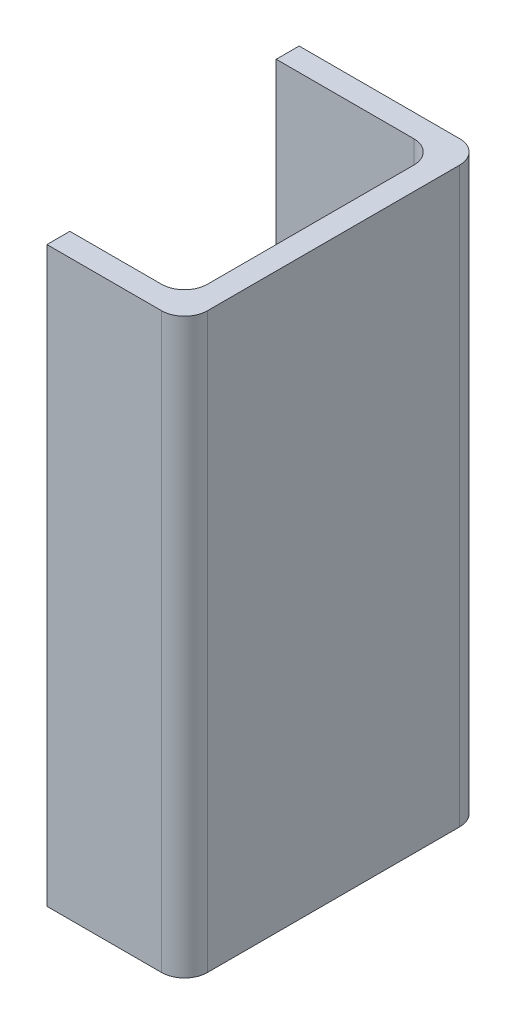
ISO-10303-21;
HEADER;
FILE_DESCRIPTION(('STEP AP214'),'2;1');
FILE_NAME('part.step','',(''),(''),'','','');
FILE_SCHEMA(('AUTOMOTIVE_DESIGN { 1 0 10303 214 1 1 1 1 }'));
ENDSEC;
DATA;
#1=APPLICATION_CONTEXT('core data for automotive mechanical design processes');
#2=APPLICATION_PROTOCOL_DEFINITION('international standard','automotive_design',2000,#1);
#3=PRODUCT_CONTEXT('',#1,'mechanical');
#4=PRODUCT('Part','Part','',(#3));
#5=PRODUCT_RELATED_PRODUCT_CATEGORY('part','',(#4));
#6=PRODUCT_DEFINITION_FORMATION('','',#4);
#7=PRODUCT_DEFINITION_CONTEXT('part definition',#1,'design');
#8=PRODUCT_DEFINITION('design','',#6,#7);
#9=PRODUCT_DEFINITION_SHAPE('','',#8);
#10=(LENGTH_UNIT() NAMED_UNIT(*) SI_UNIT(.MILLI.,.METRE.));
#11=(NAMED_UNIT(*) PLANE_ANGLE_UNIT() SI_UNIT($,.RADIAN.));
#12=(NAMED_UNIT(*) SI_UNIT($,.STERADIAN.) SOLID_ANGLE_UNIT());
#13=UNCERTAINTY_MEASURE_WITH_UNIT(LENGTH_MEASURE(1.E-05),#10,'distance_accuracy_value','');
#14=(GEOMETRIC_REPRESENTATION_CONTEXT(3) GLOBAL_UNCERTAINTY_ASSIGNED_CONTEXT((#13)) GLOBAL_UNIT_ASSIGNED_CONTEXT((#10,
#11,#12)) REPRESENTATION_CONTEXT('',''));
#15=CARTESIAN_POINT('',(0.,0.,0.));
#16=DIRECTION('',(0.,0.,1.));
#17=DIRECTION('',(1.,0.,0.));
#18=AXIS2_PLACEMENT_3D('',#15,#16,#17);
#19=CARTESIAN_POINT('',(0.9,0.625,0.0999999999999998));
#20=DIRECTION('',(0.,1.,0.));
#21=DIRECTION('',(0.707106781186548,0.,-0.707106781186548));
#22=AXIS2_PLACEMENT_3D('',#19,#20,#21);
#23=CYLINDRICAL_SURFACE('',#22,0.05);
#24=CARTESIAN_POINT('',(0.9,-0.625,0.0999999999999998));
#25=DIRECTION('',(0.,-1.,0.));
#26=DIRECTION('',(0.,0.,-1.));
#27=AXIS2_PLACEMENT_3D('',#24,#25,#26);
#28=CIRCLE('',#27,0.05);
#29=CARTESIAN_POINT('',(0.9,-0.625,0.0499999999999998));
#30=VERTEX_POINT('',#29);
#31=CARTESIAN_POINT('',(0.95,-0.625,0.0999999999999998));
#32=VERTEX_POINT('',#31);
#33=EDGE_CURVE('E11',#30,#32,#28,.T.);
#34=ORIENTED_EDGE('',*,*,#33,.T.);
#35=DIRECTION('',(0.,1.,0.));
#36=VECTOR('',#35,1.);
#37=CARTESIAN_POINT('',(0.95,-0.625,0.0999999999999998));
#38=LINE('',#37,#36);
#39=CARTESIAN_POINT('',(0.95,0.625,0.0999999999999998));
#40=VERTEX_POINT('',#39);
#41=EDGE_CURVE('E24',#32,#40,#38,.T.);
#42=ORIENTED_EDGE('',*,*,#41,.T.);
#43=CARTESIAN_POINT('',(0.9,0.625,0.0999999999999998));
#44=DIRECTION('',(0.,1.,0.));
#45=DIRECTION('',(1.,0.,0.));
#46=AXIS2_PLACEMENT_3D('',#43,#44,#45);
#47=CIRCLE('',#46,0.05);
#48=CARTESIAN_POINT('',(0.9,0.625,0.0499999999999998));
#49=VERTEX_POINT('',#48);
#50=EDGE_CURVE('E197',#40,#49,#47,.T.);
#51=ORIENTED_EDGE('',*,*,#50,.T.);
#52=DIRECTION('',(0.,-1.,0.));
#53=VECTOR('',#52,1.);
#54=CARTESIAN_POINT('',(0.9,0.625,0.0499999999999998));
#55=LINE('',#54,#53);
#56=EDGE_CURVE('E190',#49,#30,#55,.T.);
#57=ORIENTED_EDGE('',*,*,#56,.T.);
#58=EDGE_LOOP('',(#34,#42,#51,#57));
#59=FACE_BOUND('',#58,.T.);
#60=ADVANCED_FACE('F17',(#59),#23,.F.);
#61=CARTESIAN_POINT('',(0.95,0.625,0.6));
#62=DIRECTION('',(1.,0.,0.));
#63=DIRECTION('',(0.,0.,-1.));
#64=AXIS2_PLACEMENT_3D('',#61,#62,#63);
#65=PLANE('',#64);
#66=ORIENTED_EDGE('',*,*,#41,.F.);
#67=DIRECTION('',(0.,0.,-1.));
#68=VECTOR('',#67,1.);
#69=CARTESIAN_POINT('',(0.95,-0.625,0.55));
#70=LINE('',#69,#68);
#71=CARTESIAN_POINT('',(0.95,-0.625,0.55));
#72=VERTEX_POINT('',#71);
#73=EDGE_CURVE('E199',#72,#32,#70,.T.);
#74=ORIENTED_EDGE('',*,*,#73,.F.);
#75=DIRECTION('',(0.,-1.,0.));
#76=VECTOR('',#75,1.);
#77=CARTESIAN_POINT('',(0.95,0.625,0.55));
#78=LINE('',#77,#76);
#79=CARTESIAN_POINT('',(0.95,0.625,0.55));
#80=VERTEX_POINT('',#79);
#81=EDGE_CURVE('E192',#80,#72,#78,.T.);
#82=ORIENTED_EDGE('',*,*,#81,.F.);
#83=DIRECTION('',(0.,0.,1.));
#84=VECTOR('',#83,1.);
#85=CARTESIAN_POINT('',(0.95,0.625,0.0999999999999999));
#86=LINE('',#85,#84);
#87=EDGE_CURVE('E179',#40,#80,#86,.T.);
#88=ORIENTED_EDGE('',*,*,#87,.F.);
#89=EDGE_LOOP('',(#66,#74,#82,#88));
#90=FACE_BOUND('',#89,.T.);
#91=ADVANCED_FACE('F235',(#90),#65,.F.);
#92=CARTESIAN_POINT('',(0.9,0.625,0.55));
#93=DIRECTION('',(0.,1.,0.));
#94=DIRECTION('',(0.707106781186548,0.,0.707106781186548));
#95=AXIS2_PLACEMENT_3D('',#92,#93,#94);
#96=CYLINDRICAL_SURFACE('',#95,0.05);
#97=CARTESIAN_POINT('',(0.9,-0.625,0.55));
#98=DIRECTION('',(0.,-1.,0.));
#99=DIRECTION('',(1.,0.,0.));
#100=AXIS2_PLACEMENT_3D('',#97,#98,#99);
#101=CIRCLE('',#100,0.05);
#102=CARTESIAN_POINT('',(0.9,-0.625,0.6));
#103=VERTEX_POINT('',#102);
#104=EDGE_CURVE('E202',#72,#103,#101,.T.);
#105=ORIENTED_EDGE('',*,*,#104,.T.);
#106=DIRECTION('',(0.,1.,0.));
#107=VECTOR('',#106,1.);
#108=CARTESIAN_POINT('',(0.9,-0.625,0.6));
#109=LINE('',#108,#107);
#110=CARTESIAN_POINT('',(0.9,0.625,0.6));
#111=VERTEX_POINT('',#110);
#112=EDGE_CURVE('E195',#103,#111,#109,.T.);
#113=ORIENTED_EDGE('',*,*,#112,.T.);
#114=CARTESIAN_POINT('',(0.9,0.625,0.55));
#115=DIRECTION('',(0.,1.,0.));
#116=DIRECTION('',(0.,0.,1.));
#117=AXIS2_PLACEMENT_3D('',#114,#115,#116);
#118=CIRCLE('',#117,0.05);
#119=EDGE_CURVE('E182',#111,#80,#118,.T.);
#120=ORIENTED_EDGE('',*,*,#119,.T.);
#121=ORIENTED_EDGE('',*,*,#81,.T.);
#122=EDGE_LOOP('',(#105,#113,#120,#121));
#123=FACE_BOUND('',#122,.T.);
#124=ADVANCED_FACE('F206',(#123),#96,.F.);
#125=CARTESIAN_POINT('',(-0.95,0.625,0.6));
#126=DIRECTION('',(0.,0.,1.));
#127=DIRECTION('',(1.,0.,0.));
#128=AXIS2_PLACEMENT_3D('',#125,#126,#127);
#129=PLANE('',#128);
#130=ORIENTED_EDGE('',*,*,#112,.F.);
#131=DIRECTION('',(1.,0.,0.));
#132=VECTOR('',#131,1.);
#133=CARTESIAN_POINT('',(0.7,-0.625,0.6));
#134=LINE('',#133,#132);
#135=CARTESIAN_POINT('',(0.7,-0.625,0.6));
#136=VERTEX_POINT('',#135);
#137=EDGE_CURVE('E185',#136,#103,#134,.T.);
#138=ORIENTED_EDGE('',*,*,#137,.F.);
#139=DIRECTION('',(0.,-1.,0.));
#140=VECTOR('',#139,1.);
#141=CARTESIAN_POINT('',(0.7,0.625,0.6));
#142=LINE('',#141,#140);
#143=CARTESIAN_POINT('',(0.7,0.625,0.6));
#144=VERTEX_POINT('',#143);
#145=EDGE_CURVE('E172',#144,#136,#142,.T.);
#146=ORIENTED_EDGE('',*,*,#145,.F.);
#147=DIRECTION('',(-1.,0.,0.));
#148=VECTOR('',#147,1.);
#149=CARTESIAN_POINT('',(0.9,0.625,0.6));
#150=LINE('',#149,#148);
#151=EDGE_CURVE('E128',#111,#144,#150,.T.);
#152=ORIENTED_EDGE('',*,*,#151,.F.);
#153=EDGE_LOOP('',(#130,#138,#146,#152));
#154=FACE_BOUND('',#153,.T.);
#155=ADVANCED_FACE('F209',(#154),#129,.F.);
#156=CARTESIAN_POINT('',(0.95,-0.3125,0.05));
#157=DIRECTION('',(0.,1.,0.));
#158=DIRECTION('',(0.707106781186548,0.,-0.707106781186547));
#159=AXIS2_PLACEMENT_3D('',#156,#157,#158);
#160=CYLINDRICAL_SURFACE('',#159,0.05);
#161=CARTESIAN_POINT('',(0.95,0.625,0.05));
#162=DIRECTION('',(0.,-1.,0.));
#163=DIRECTION('',(0.,0.,-1.));
#164=AXIS2_PLACEMENT_3D('',#161,#162,#163);
#165=CIRCLE('',#164,0.05);
#166=CARTESIAN_POINT('',(0.95,0.625,0.));
#167=VERTEX_POINT('',#166);
#168=CARTESIAN_POINT('',(1.,0.625,0.05));
#169=VERTEX_POINT('',#168);
#170=EDGE_CURVE('E188',#167,#169,#165,.T.);
#171=ORIENTED_EDGE('',*,*,#170,.T.);
#172=DIRECTION('',(0.,-1.,0.));
#173=VECTOR('',#172,1.);
#174=CARTESIAN_POINT('',(1.,0.625,0.05));
#175=LINE('',#174,#173);
#176=CARTESIAN_POINT('',(1.,-0.625,0.05));
#177=VERTEX_POINT('',#176);
#178=EDGE_CURVE('E174',#169,#177,#175,.T.);
#179=ORIENTED_EDGE('',*,*,#178,.T.);
#180=CARTESIAN_POINT('',(0.95,-0.625,0.05));
#181=DIRECTION('',(0.,1.,0.));
#182=DIRECTION('',(1.,0.,0.));
#183=AXIS2_PLACEMENT_3D('',#180,#181,#182);
#184=CIRCLE('',#183,0.05);
#185=CARTESIAN_POINT('',(0.95,-0.625,0.));
#186=VERTEX_POINT('',#185);
#187=EDGE_CURVE('E177',#177,#186,#184,.T.);
#188=ORIENTED_EDGE('',*,*,#187,.T.);
#189=DIRECTION('',(0.,1.,0.));
#190=VECTOR('',#189,1.);
#191=CARTESIAN_POINT('',(0.95,-0.625,0.));
#192=LINE('',#191,#190);
#193=EDGE_CURVE('E160',#186,#167,#192,.T.);
#194=ORIENTED_EDGE('',*,*,#193,.T.);
#195=EDGE_LOOP('',(#171,#179,#188,#194));
#196=FACE_BOUND('',#195,.T.);
#197=ADVANCED_FACE('F221',(#196),#160,.T.);
#198=CARTESIAN_POINT('',(-1.,-0.625,0.));
#199=DIRECTION('',(0.,-1.,0.));
#200=DIRECTION('',(1.,0.,0.));
#201=AXIS2_PLACEMENT_3D('',#198,#199,#200);
#202=PLANE('',#201);
#203=ORIENTED_EDGE('',*,*,#187,.F.);
#204=DIRECTION('',(0.,0.,1.));
#205=VECTOR('',#204,1.);
#206=CARTESIAN_POINT('',(1.,-0.625,0.05));
#207=LINE('',#206,#205);
#208=CARTESIAN_POINT('',(1.,-0.625,0.6));
#209=VERTEX_POINT('',#208);
#210=EDGE_CURVE('E170',#177,#209,#207,.T.);
#211=ORIENTED_EDGE('',*,*,#210,.T.);
#212=CARTESIAN_POINT('',(0.95,-0.625,0.6));
#213=DIRECTION('',(0.,1.,0.));
#214=DIRECTION('',(0.,0.,1.));
#215=AXIS2_PLACEMENT_3D('',#212,#213,#214);
#216=CIRCLE('',#215,0.05);
#217=CARTESIAN_POINT('',(0.95,-0.625,0.65));
#218=VERTEX_POINT('',#217);
#219=EDGE_CURVE('E162',#218,#209,#216,.T.);
#220=ORIENTED_EDGE('',*,*,#219,.F.);
#221=DIRECTION('',(1.,0.,0.));
#222=VECTOR('',#221,1.);
#223=CARTESIAN_POINT('',(0.7,-0.625,0.65));
#224=LINE('',#223,#222);
#225=CARTESIAN_POINT('',(0.7,-0.625,0.65));
#226=VERTEX_POINT('',#225);
#227=EDGE_CURVE('E154',#226,#218,#224,.T.);
#228=ORIENTED_EDGE('',*,*,#227,.F.);
#229=DIRECTION('',(0.,0.,-1.));
#230=VECTOR('',#229,1.);
#231=CARTESIAN_POINT('',(0.7,-0.625,0.65));
#232=LINE('',#231,#230);
#233=EDGE_CURVE('E109',#226,#136,#232,.T.);
#234=ORIENTED_EDGE('',*,*,#233,.T.);
#235=ORIENTED_EDGE('',*,*,#137,.T.);
#236=ORIENTED_EDGE('',*,*,#104,.F.);
#237=ORIENTED_EDGE('',*,*,#73,.T.);
#238=ORIENTED_EDGE('',*,*,#33,.F.);
#239=DIRECTION('',(-1.,0.,0.));
#240=VECTOR('',#239,1.);
#241=CARTESIAN_POINT('',(0.9,-0.625,0.0499999999999998));
#242=LINE('',#241,#240);
#243=CARTESIAN_POINT('',(0.600017415079809,-0.625,0.05));
#244=VERTEX_POINT('',#243);
#245=EDGE_CURVE('E112',#30,#244,#242,.T.);
#246=ORIENTED_EDGE('',*,*,#245,.T.);
#247=DIRECTION('',(0.,0.,-1.));
#248=VECTOR('',#247,1.);
#249=CARTESIAN_POINT('',(0.600017415079809,-0.625,0.05));
#250=LINE('',#249,#248);
#251=CARTESIAN_POINT('',(0.600017415079809,-0.625,0.));
#252=VERTEX_POINT('',#251);
#253=EDGE_CURVE('E151',#244,#252,#250,.T.);
#254=ORIENTED_EDGE('',*,*,#253,.T.);
#255=DIRECTION('',(1.,0.,0.));
#256=VECTOR('',#255,1.);
#257=CARTESIAN_POINT('',(0.600017415079809,-0.625,0.));
#258=LINE('',#257,#256);
#259=EDGE_CURVE('E141',#252,#186,#258,.T.);
#260=ORIENTED_EDGE('',*,*,#259,.T.);
#261=EDGE_LOOP('',(#203,#211,#220,#228,#234,#235,#236,#237,#238,#246,#254,#260));
#262=FACE_BOUND('',#261,.T.);
#263=ADVANCED_FACE('F210',(#262),#202,.T.);
#264=CARTESIAN_POINT('',(1.,-0.625,0.));
#265=DIRECTION('',(1.,0.,0.));
#266=DIRECTION('',(0.,1.,0.));
#267=AXIS2_PLACEMENT_3D('',#264,#265,#266);
#268=PLANE('',#267);
#269=ORIENTED_EDGE('',*,*,#178,.F.);
#270=DIRECTION('',(0.,0.,1.));
#271=VECTOR('',#270,1.);
#272=CARTESIAN_POINT('',(1.,0.625,0.05));
#273=LINE('',#272,#271);
#274=CARTESIAN_POINT('',(1.,0.625,0.6));
#275=VERTEX_POINT('',#274);
#276=EDGE_CURVE('E165',#169,#275,#273,.T.);
#277=ORIENTED_EDGE('',*,*,#276,.T.);
#278=DIRECTION('',(0.,1.,0.));
#279=VECTOR('',#278,1.);
#280=CARTESIAN_POINT('',(1.,-0.625,0.6));
#281=LINE('',#280,#279);
#282=EDGE_CURVE('E156',#209,#275,#281,.T.);
#283=ORIENTED_EDGE('',*,*,#282,.F.);
#284=ORIENTED_EDGE('',*,*,#210,.F.);
#285=EDGE_LOOP('',(#269,#277,#283,#284));
#286=FACE_BOUND('',#285,.T.);
#287=ADVANCED_FACE('F219',(#286),#268,.T.);
#288=CARTESIAN_POINT('',(0.95,-0.3125,0.6));
#289=DIRECTION('',(0.,1.,0.));
#290=DIRECTION('',(0.707106781186548,0.,0.707106781186548));
#291=AXIS2_PLACEMENT_3D('',#288,#289,#290);
#292=CYLINDRICAL_SURFACE('',#291,0.05);
#293=CARTESIAN_POINT('',(0.95,0.625,0.6));
#294=DIRECTION('',(0.,-1.,0.));
#295=DIRECTION('',(1.,0.,0.));
#296=AXIS2_PLACEMENT_3D('',#293,#294,#295);
#297=CIRCLE('',#296,0.05);
#298=CARTESIAN_POINT('',(0.95,0.625,0.65));
#299=VERTEX_POINT('',#298);
#300=EDGE_CURVE('E167',#275,#299,#297,.T.);
#301=ORIENTED_EDGE('',*,*,#300,.T.);
#302=DIRECTION('',(0.,-1.,0.));
#303=VECTOR('',#302,1.);
#304=CARTESIAN_POINT('',(0.95,0.625,0.65));
#305=LINE('',#304,#303);
#306=EDGE_CURVE('E120',#299,#218,#305,.T.);
#307=ORIENTED_EDGE('',*,*,#306,.T.);
#308=ORIENTED_EDGE('',*,*,#219,.T.);
#309=ORIENTED_EDGE('',*,*,#282,.T.);
#310=EDGE_LOOP('',(#301,#307,#308,#309));
#311=FACE_BOUND('',#310,.T.);
#312=ADVANCED_FACE('F214',(#311),#292,.T.);
#313=CARTESIAN_POINT('',(0.95,0.625,0.0499999999999998));
#314=DIRECTION('',(0.,0.,-1.));
#315=DIRECTION('',(-1.,0.,0.));
#316=AXIS2_PLACEMENT_3D('',#313,#314,#315);
#317=PLANE('',#316);
#318=ORIENTED_EDGE('',*,*,#56,.F.);
#319=DIRECTION('',(1.,0.,0.));
#320=VECTOR('',#319,1.);
#321=CARTESIAN_POINT('',(0.600017415079809,0.625,0.0499999999999999));
#322=LINE('',#321,#320);
#323=CARTESIAN_POINT('',(0.600017415079809,0.625,0.05));
#324=VERTEX_POINT('',#323);
#325=EDGE_CURVE('E148',#324,#49,#322,.T.);
#326=ORIENTED_EDGE('',*,*,#325,.F.);
#327=DIRECTION('',(0.,1.,0.));
#328=VECTOR('',#327,1.);
#329=CARTESIAN_POINT('',(0.600017415079809,-0.625,0.05));
#330=LINE('',#329,#328);
#331=EDGE_CURVE('E144',#244,#324,#330,.T.);
#332=ORIENTED_EDGE('',*,*,#331,.F.);
#333=ORIENTED_EDGE('',*,*,#245,.F.);
#334=EDGE_LOOP('',(#318,#326,#332,#333));
#335=FACE_BOUND('',#334,.T.);
#336=ADVANCED_FACE('F232',(#335),#317,.F.);
#337=CARTESIAN_POINT('',(0.600017415079809,-0.84306281813489,0.));
#338=DIRECTION('',(1.,0.,0.));
#339=DIRECTION('',(0.,1.,0.));
#340=AXIS2_PLACEMENT_3D('',#337,#338,#339);
#341=PLANE('',#340);
#342=ORIENTED_EDGE('',*,*,#253,.F.);
#343=ORIENTED_EDGE('',*,*,#331,.T.);
#344=DIRECTION('',(0.,0.,1.));
#345=VECTOR('',#344,1.);
#346=CARTESIAN_POINT('',(0.600017415079809,0.625,0.));
#347=LINE('',#346,#345);
#348=CARTESIAN_POINT('',(0.600017415079809,0.625,0.));
#349=VERTEX_POINT('',#348);
#350=EDGE_CURVE('E138',#349,#324,#347,.T.);
#351=ORIENTED_EDGE('',*,*,#350,.F.);
#352=DIRECTION('',(0.,1.,0.));
#353=VECTOR('',#352,1.);
#354=CARTESIAN_POINT('',(0.600017415079809,-0.625,0.));
#355=LINE('',#354,#353);
#356=EDGE_CURVE('E113',#252,#349,#355,.T.);
#357=ORIENTED_EDGE('',*,*,#356,.F.);
#358=EDGE_LOOP('',(#342,#343,#351,#357));
#359=FACE_BOUND('',#358,.T.);
#360=ADVANCED_FACE('F229',(#359),#341,.F.);
#361=CARTESIAN_POINT('',(0.,0.,0.));
#362=DIRECTION('',(0.,0.,1.));
#363=DIRECTION('',(1.,0.,0.));
#364=AXIS2_PLACEMENT_3D('',#361,#362,#363);
#365=PLANE('',#364);
#366=ORIENTED_EDGE('',*,*,#193,.F.);
#367=ORIENTED_EDGE('',*,*,#259,.F.);
#368=ORIENTED_EDGE('',*,*,#356,.T.);
#369=DIRECTION('',(-1.,0.,0.));
#370=VECTOR('',#369,1.);
#371=CARTESIAN_POINT('',(0.95,0.625,0.));
#372=LINE('',#371,#370);
#373=EDGE_CURVE('E129',#167,#349,#372,.T.);
#374=ORIENTED_EDGE('',*,*,#373,.F.);
#375=EDGE_LOOP('',(#366,#367,#368,#374));
#376=FACE_BOUND('',#375,.T.);
#377=ADVANCED_FACE('F224',(#376),#365,.F.);
#378=CARTESIAN_POINT('',(0.7,1.69885678434986,0.65));
#379=DIRECTION('',(1.,0.,0.));
#380=DIRECTION('',(0.,-1.,0.));
#381=AXIS2_PLACEMENT_3D('',#378,#379,#380);
#382=PLANE('',#381);
#383=ORIENTED_EDGE('',*,*,#233,.F.);
#384=DIRECTION('',(0.,-1.,0.));
#385=VECTOR('',#384,1.);
#386=CARTESIAN_POINT('',(0.7,0.625,0.65));
#387=LINE('',#386,#385);
#388=CARTESIAN_POINT('',(0.7,0.625,0.65));
#389=VERTEX_POINT('',#388);
#390=EDGE_CURVE('E101',#389,#226,#387,.T.);
#391=ORIENTED_EDGE('',*,*,#390,.F.);
#392=DIRECTION('',(0.,0.,1.));
#393=VECTOR('',#392,1.);
#394=CARTESIAN_POINT('',(0.7,0.625,0.6));
#395=LINE('',#394,#393);
#396=EDGE_CURVE('E106',#144,#389,#395,.T.);
#397=ORIENTED_EDGE('',*,*,#396,.F.);
#398=ORIENTED_EDGE('',*,*,#145,.T.);
#399=EDGE_LOOP('',(#383,#391,#397,#398));
#400=FACE_BOUND('',#399,.T.);
#401=ADVANCED_FACE('F103',(#400),#382,.F.);
#402=CARTESIAN_POINT('',(1.,0.625,0.));
#403=DIRECTION('',(0.,1.,0.));
#404=DIRECTION('',(-1.,0.,0.));
#405=AXIS2_PLACEMENT_3D('',#402,#403,#404);
#406=PLANE('',#405);
#407=ORIENTED_EDGE('',*,*,#170,.F.);
#408=ORIENTED_EDGE('',*,*,#373,.T.);
#409=ORIENTED_EDGE('',*,*,#350,.T.);
#410=ORIENTED_EDGE('',*,*,#325,.T.);
#411=ORIENTED_EDGE('',*,*,#50,.F.);
#412=ORIENTED_EDGE('',*,*,#87,.T.);
#413=ORIENTED_EDGE('',*,*,#119,.F.);
#414=ORIENTED_EDGE('',*,*,#151,.T.);
#415=ORIENTED_EDGE('',*,*,#396,.T.);
#416=DIRECTION('',(-1.,0.,0.));
#417=VECTOR('',#416,1.);
#418=CARTESIAN_POINT('',(0.95,0.625,0.65));
#419=LINE('',#418,#417);
#420=EDGE_CURVE('E117',#299,#389,#419,.T.);
#421=ORIENTED_EDGE('',*,*,#420,.F.);
#422=ORIENTED_EDGE('',*,*,#300,.F.);
#423=ORIENTED_EDGE('',*,*,#276,.F.);
#424=EDGE_LOOP('',(#407,#408,#409,#410,#411,#412,#413,#414,#415,#421,#422,#423));
#425=FACE_BOUND('',#424,.T.);
#426=ADVANCED_FACE('F125',(#425),#406,.T.);
#427=CARTESIAN_POINT('',(0.,0.,0.65));
#428=DIRECTION('',(0.,0.,1.));
#429=DIRECTION('',(1.,0.,0.));
#430=AXIS2_PLACEMENT_3D('',#427,#428,#429);
#431=PLANE('',#430);
#432=ORIENTED_EDGE('',*,*,#306,.F.);
#433=ORIENTED_EDGE('',*,*,#420,.T.);
#434=ORIENTED_EDGE('',*,*,#390,.T.);
#435=ORIENTED_EDGE('',*,*,#227,.T.);
#436=EDGE_LOOP('',(#432,#433,#434,#435));
#437=FACE_BOUND('',#436,.T.);
#438=ADVANCED_FACE('F118',(#437),#431,.T.);
#439=CLOSED_SHELL('',(#60,#91,#124,#155,#197,#263,#287,#312,#336,#360,#377,#401,#426,#438));
#440=MANIFOLD_SOLID_BREP('B1',#439);
#441=ADVANCED_BREP_SHAPE_REPRESENTATION('',(#18,#440),#14);
#442=SHAPE_DEFINITION_REPRESENTATION(#9,#441);
ENDSEC;
END-ISO-10303-21;
